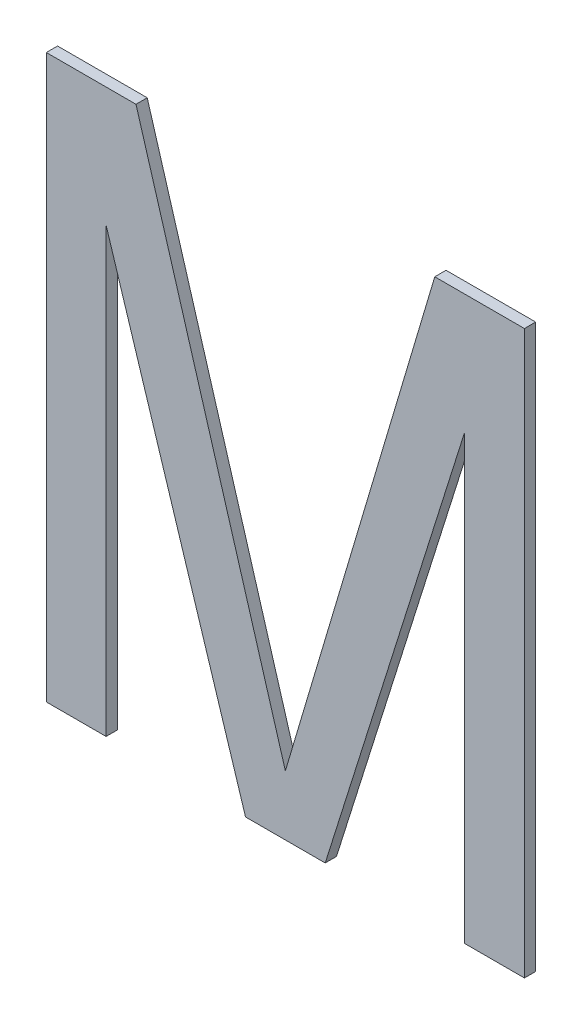
ISO-10303-21;
HEADER;
FILE_DESCRIPTION(('STEP AP214'),'2;1');
FILE_NAME('part.step','',(''),(''),'','','');
FILE_SCHEMA(('AUTOMOTIVE_DESIGN { 1 0 10303 214 1 1 1 1 }'));
ENDSEC;
DATA;
#1=APPLICATION_CONTEXT('core data for automotive mechanical design processes');
#2=APPLICATION_PROTOCOL_DEFINITION('international standard','automotive_design',2000,#1);
#3=PRODUCT_CONTEXT('',#1,'mechanical');
#4=PRODUCT('Part','Part','',(#3));
#5=PRODUCT_RELATED_PRODUCT_CATEGORY('part','',(#4));
#6=PRODUCT_DEFINITION_FORMATION('','',#4);
#7=PRODUCT_DEFINITION_CONTEXT('part definition',#1,'design');
#8=PRODUCT_DEFINITION('design','',#6,#7);
#9=PRODUCT_DEFINITION_SHAPE('','',#8);
#10=(LENGTH_UNIT() NAMED_UNIT(*) SI_UNIT(.MILLI.,.METRE.));
#11=(NAMED_UNIT(*) PLANE_ANGLE_UNIT() SI_UNIT($,.RADIAN.));
#12=(NAMED_UNIT(*) SI_UNIT($,.STERADIAN.) SOLID_ANGLE_UNIT());
#13=UNCERTAINTY_MEASURE_WITH_UNIT(LENGTH_MEASURE(1.E-05),#10,'distance_accuracy_value','');
#14=(GEOMETRIC_REPRESENTATION_CONTEXT(3) GLOBAL_UNCERTAINTY_ASSIGNED_CONTEXT((#13)) GLOBAL_UNIT_ASSIGNED_CONTEXT((#10,
#11,#12)) REPRESENTATION_CONTEXT('',''));
#15=CARTESIAN_POINT('',(0.,0.,0.));
#16=DIRECTION('',(0.,0.,1.));
#17=DIRECTION('',(1.,0.,0.));
#18=AXIS2_PLACEMENT_3D('',#15,#16,#17);
#19=CARTESIAN_POINT('',(152.162872740253,142.200586634191,6.));
#20=DIRECTION('',(0.,0.,1.));
#21=DIRECTION('',(1.,0.,0.));
#22=AXIS2_PLACEMENT_3D('',#19,#20,#21);
#23=PLANE('',#22);
#24=DIRECTION('',(0.28492599218727,-0.958549518270235,0.));
#25=VECTOR('',#24,1.);
#26=CARTESIAN_POINT('',(154.287872740253,142.732501538901,6.));
#27=LINE('',#26,#25);
#28=CARTESIAN_POINT('',(154.287872740253,142.732501538901,6.));
#29=VERTEX_POINT('',#28);
#30=CARTESIAN_POINT('',(152.959747740253,147.200586634191,6.));
#31=VERTEX_POINT('',#30);
#32=EDGE_CURVE('E170',#29,#31,#27,.F.);
#33=ORIENTED_EDGE('',*,*,#32,.T.);
#34=DIRECTION('',(1.,0.,0.));
#35=VECTOR('',#34,1.);
#36=CARTESIAN_POINT('',(152.959747740253,147.200586634191,6.));
#37=LINE('',#36,#35);
#38=CARTESIAN_POINT('',(152.162872740253,147.200586634191,6.));
#39=VERTEX_POINT('',#38);
#40=EDGE_CURVE('E175',#31,#39,#37,.F.);
#41=ORIENTED_EDGE('',*,*,#40,.T.);
#42=DIRECTION('',(0.,1.,0.));
#43=VECTOR('',#42,1.);
#44=CARTESIAN_POINT('',(152.162872740253,147.200586634191,6.));
#45=LINE('',#44,#43);
#46=CARTESIAN_POINT('',(152.162872740253,142.200586634191,6.));
#47=VERTEX_POINT('',#46);
#48=EDGE_CURVE('E112',#39,#47,#45,.F.);
#49=ORIENTED_EDGE('',*,*,#48,.T.);
#50=DIRECTION('',(1.,0.,0.));
#51=VECTOR('',#50,1.);
#52=CARTESIAN_POINT('',(152.162872740253,142.200586634191,6.));
#53=LINE('',#52,#51);
#54=CARTESIAN_POINT('',(152.694122740253,142.200586634191,6.));
#55=VERTEX_POINT('',#54);
#56=EDGE_CURVE('E20',#47,#55,#53,.T.);
#57=ORIENTED_EDGE('',*,*,#56,.T.);
#58=DIRECTION('',(0.,1.,0.));
#59=VECTOR('',#58,1.);
#60=CARTESIAN_POINT('',(152.694122740253,142.200586634191,6.));
#61=LINE('',#60,#59);
#62=CARTESIAN_POINT('',(152.694122740253,146.136756973771,6.));
#63=VERTEX_POINT('',#62);
#64=EDGE_CURVE('E109',#55,#63,#61,.T.);
#65=ORIENTED_EDGE('',*,*,#64,.T.);
#66=DIRECTION('',(-0.300378236881696,0.953820169008731,0.));
#67=VECTOR('',#66,1.);
#68=CARTESIAN_POINT('',(152.694122740253,146.136756973771,6.));
#69=LINE('',#68,#67);
#70=CARTESIAN_POINT('',(153.933706411353,142.200586634191,6.));
#71=VERTEX_POINT('',#70);
#72=EDGE_CURVE('E130',#63,#71,#69,.F.);
#73=ORIENTED_EDGE('',*,*,#72,.T.);
#74=DIRECTION('',(1.,0.,0.));
#75=VECTOR('',#74,1.);
#76=CARTESIAN_POINT('',(153.933706411353,142.200586634191,6.));
#77=LINE('',#76,#75);
#78=CARTESIAN_POINT('',(154.642039575803,142.200586634191,6.));
#79=VERTEX_POINT('',#78);
#80=EDGE_CURVE('E135',#71,#79,#77,.T.);
#81=ORIENTED_EDGE('',*,*,#80,.T.);
#82=DIRECTION('',(-0.300378236879487,-0.953820169009426,0.));
#83=VECTOR('',#82,1.);
#84=CARTESIAN_POINT('',(154.642039575803,142.200586634191,6.));
#85=LINE('',#84,#83);
#86=CARTESIAN_POINT('',(155.881623246893,146.136756973771,6.));
#87=VERTEX_POINT('',#86);
#88=EDGE_CURVE('E140',#79,#87,#85,.F.);
#89=ORIENTED_EDGE('',*,*,#88,.T.);
#90=DIRECTION('',(0.,1.,0.));
#91=VECTOR('',#90,1.);
#92=CARTESIAN_POINT('',(155.881623246893,146.136756973771,6.));
#93=LINE('',#92,#91);
#94=CARTESIAN_POINT('',(155.881623246893,142.200586634191,6.));
#95=VERTEX_POINT('',#94);
#96=EDGE_CURVE('E145',#87,#95,#93,.F.);
#97=ORIENTED_EDGE('',*,*,#96,.T.);
#98=DIRECTION('',(1.,0.,0.));
#99=VECTOR('',#98,1.);
#100=CARTESIAN_POINT('',(155.881623246893,142.200586634191,6.));
#101=LINE('',#100,#99);
#102=CARTESIAN_POINT('',(156.412873246893,142.200586634191,6.));
#103=VERTEX_POINT('',#102);
#104=EDGE_CURVE('E150',#95,#103,#101,.T.);
#105=ORIENTED_EDGE('',*,*,#104,.T.);
#106=DIRECTION('',(0.,1.,0.));
#107=VECTOR('',#106,1.);
#108=CARTESIAN_POINT('',(156.412873246893,142.200586634191,6.));
#109=LINE('',#108,#107);
#110=CARTESIAN_POINT('',(156.412873246893,147.200586634191,6.));
#111=VERTEX_POINT('',#110);
#112=EDGE_CURVE('E155',#103,#111,#109,.T.);
#113=ORIENTED_EDGE('',*,*,#112,.T.);
#114=DIRECTION('',(1.,0.,0.));
#115=VECTOR('',#114,1.);
#116=CARTESIAN_POINT('',(156.412873246893,147.200586634191,6.));
#117=LINE('',#116,#115);
#118=CARTESIAN_POINT('',(155.615998246893,147.200586634191,6.));
#119=VERTEX_POINT('',#118);
#120=EDGE_CURVE('E160',#111,#119,#117,.F.);
#121=ORIENTED_EDGE('',*,*,#120,.T.);
#122=DIRECTION('',(0.284926092054197,0.958549488585083,0.));
#123=VECTOR('',#122,1.);
#124=CARTESIAN_POINT('',(155.615998246893,147.200586634191,6.));
#125=LINE('',#124,#123);
#126=EDGE_CURVE('E165',#119,#29,#125,.F.);
#127=ORIENTED_EDGE('',*,*,#126,.T.);
#128=EDGE_LOOP('',(#33,#41,#49,#57,#65,#73,#81,#89,#97,#105,#113,#121,#127));
#129=FACE_BOUND('',#128,.T.);
#130=ADVANCED_FACE('F17',(#129),#23,.T.);
#131=CARTESIAN_POINT('',(152.162872740253,142.200586634191,6.));
#132=DIRECTION('',(0.,1.,0.));
#133=DIRECTION('',(0.,0.,1.));
#134=AXIS2_PLACEMENT_3D('',#131,#132,#133);
#135=PLANE('',#134);
#136=DIRECTION('',(0.,0.,1.));
#137=VECTOR('',#136,1.);
#138=CARTESIAN_POINT('',(152.694122740253,142.200586634191,6.));
#139=LINE('',#138,#137);
#140=CARTESIAN_POINT('',(152.694122740253,142.200586634191,5.9));
#141=VERTEX_POINT('',#140);
#142=EDGE_CURVE('E117',#141,#55,#139,.T.);
#143=ORIENTED_EDGE('',*,*,#142,.T.);
#144=ORIENTED_EDGE('',*,*,#56,.F.);
#145=DIRECTION('',(0.,0.,-1.));
#146=VECTOR('',#145,1.);
#147=CARTESIAN_POINT('',(152.162872740253,142.200586634191,6.));
#148=LINE('',#147,#146);
#149=CARTESIAN_POINT('',(152.162872740253,142.200586634191,5.9));
#150=VERTEX_POINT('',#149);
#151=EDGE_CURVE('E179',#47,#150,#148,.T.);
#152=ORIENTED_EDGE('',*,*,#151,.T.);
#153=DIRECTION('',(1.,0.,0.));
#154=VECTOR('',#153,1.);
#155=CARTESIAN_POINT('',(152.162872740253,142.200586634191,5.9));
#156=LINE('',#155,#154);
#157=EDGE_CURVE('E127',#150,#141,#156,.T.);
#158=ORIENTED_EDGE('',*,*,#157,.T.);
#159=EDGE_LOOP('',(#143,#144,#152,#158));
#160=FACE_BOUND('',#159,.T.);
#161=ADVANCED_FACE('F126',(#160),#135,.F.);
#162=CARTESIAN_POINT('',(152.694122740253,142.200586634191,6.));
#163=DIRECTION('',(-1.,0.,0.));
#164=DIRECTION('',(0.,0.,1.));
#165=AXIS2_PLACEMENT_3D('',#162,#163,#164);
#166=PLANE('',#165);
#167=DIRECTION('',(0.,0.,1.));
#168=VECTOR('',#167,1.);
#169=CARTESIAN_POINT('',(152.694122740253,146.136756973771,6.));
#170=LINE('',#169,#168);
#171=CARTESIAN_POINT('',(152.694122740253,146.136756973771,5.9));
#172=VERTEX_POINT('',#171);
#173=EDGE_CURVE('E123',#172,#63,#170,.T.);
#174=ORIENTED_EDGE('',*,*,#173,.T.);
#175=ORIENTED_EDGE('',*,*,#64,.F.);
#176=ORIENTED_EDGE('',*,*,#142,.F.);
#177=DIRECTION('',(0.,1.,0.));
#178=VECTOR('',#177,1.);
#179=CARTESIAN_POINT('',(152.694122740253,142.200586634191,5.9));
#180=LINE('',#179,#178);
#181=EDGE_CURVE('E182',#141,#172,#180,.T.);
#182=ORIENTED_EDGE('',*,*,#181,.T.);
#183=EDGE_LOOP('',(#174,#175,#176,#182));
#184=FACE_BOUND('',#183,.T.);
#185=ADVANCED_FACE('F120',(#184),#166,.F.);
#186=CARTESIAN_POINT('',(152.694122740253,146.136756973771,6.));
#187=DIRECTION('',(0.953820169008731,0.300378236881696,0.));
#188=DIRECTION('',(-0.300378236881696,0.953820169008731,0.));
#189=AXIS2_PLACEMENT_3D('',#186,#187,#188);
#190=PLANE('',#189);
#191=DIRECTION('',(0.,0.,1.));
#192=VECTOR('',#191,1.);
#193=CARTESIAN_POINT('',(153.933706411353,142.200586634191,6.));
#194=LINE('',#193,#192);
#195=CARTESIAN_POINT('',(153.933706411353,142.200586634191,5.9));
#196=VERTEX_POINT('',#195);
#197=EDGE_CURVE('E132',#196,#71,#194,.T.);
#198=ORIENTED_EDGE('',*,*,#197,.T.);
#199=ORIENTED_EDGE('',*,*,#72,.F.);
#200=ORIENTED_EDGE('',*,*,#173,.F.);
#201=DIRECTION('',(0.300378236881714,-0.953820169008725,0.));
#202=VECTOR('',#201,1.);
#203=CARTESIAN_POINT('',(152.694122740253,146.136756973771,5.9));
#204=LINE('',#203,#202);
#205=EDGE_CURVE('E184',#172,#196,#204,.T.);
#206=ORIENTED_EDGE('',*,*,#205,.T.);
#207=EDGE_LOOP('',(#198,#199,#200,#206));
#208=FACE_BOUND('',#207,.T.);
#209=ADVANCED_FACE('F252',(#208),#190,.F.);
#210=CARTESIAN_POINT('',(153.933706411353,142.200586634191,6.));
#211=DIRECTION('',(0.,1.,0.));
#212=DIRECTION('',(0.,0.,1.));
#213=AXIS2_PLACEMENT_3D('',#210,#211,#212);
#214=PLANE('',#213);
#215=DIRECTION('',(0.,0.,1.));
#216=VECTOR('',#215,1.);
#217=CARTESIAN_POINT('',(154.642039575803,142.200586634191,6.));
#218=LINE('',#217,#216);
#219=CARTESIAN_POINT('',(154.642039575803,142.200586634191,5.9));
#220=VERTEX_POINT('',#219);
#221=EDGE_CURVE('E137',#220,#79,#218,.T.);
#222=ORIENTED_EDGE('',*,*,#221,.T.);
#223=ORIENTED_EDGE('',*,*,#80,.F.);
#224=ORIENTED_EDGE('',*,*,#197,.F.);
#225=DIRECTION('',(1.,0.,0.));
#226=VECTOR('',#225,1.);
#227=CARTESIAN_POINT('',(152.162872740253,142.200586634191,5.9));
#228=LINE('',#227,#226);
#229=EDGE_CURVE('E187',#196,#220,#228,.T.);
#230=ORIENTED_EDGE('',*,*,#229,.T.);
#231=EDGE_LOOP('',(#222,#223,#224,#230));
#232=FACE_BOUND('',#231,.T.);
#233=ADVANCED_FACE('F249',(#232),#214,.F.);
#234=CARTESIAN_POINT('',(154.642039575803,142.200586634191,6.));
#235=DIRECTION('',(-0.953820169009426,0.300378236879487,0.));
#236=DIRECTION('',(-0.300378236879487,-0.953820169009426,0.));
#237=AXIS2_PLACEMENT_3D('',#234,#235,#236);
#238=PLANE('',#237);
#239=DIRECTION('',(0.,0.,-1.));
#240=VECTOR('',#239,1.);
#241=CARTESIAN_POINT('',(155.881623246893,146.136756973771,6.));
#242=LINE('',#241,#240);
#243=CARTESIAN_POINT('',(155.881623246893,146.136756973771,5.9));
#244=VERTEX_POINT('',#243);
#245=EDGE_CURVE('E142',#244,#87,#242,.F.);
#246=ORIENTED_EDGE('',*,*,#245,.T.);
#247=ORIENTED_EDGE('',*,*,#88,.F.);
#248=ORIENTED_EDGE('',*,*,#221,.F.);
#249=DIRECTION('',(0.300378236879493,0.953820169009425,0.));
#250=VECTOR('',#249,1.);
#251=CARTESIAN_POINT('',(154.642039575803,142.200586634191,5.9));
#252=LINE('',#251,#250);
#253=EDGE_CURVE('E190',#220,#244,#252,.T.);
#254=ORIENTED_EDGE('',*,*,#253,.T.);
#255=EDGE_LOOP('',(#246,#247,#248,#254));
#256=FACE_BOUND('',#255,.T.);
#257=ADVANCED_FACE('F245',(#256),#238,.F.);
#258=CARTESIAN_POINT('',(155.881623246893,146.136756973771,6.));
#259=DIRECTION('',(1.,0.,0.));
#260=DIRECTION('',(0.,0.,-1.));
#261=AXIS2_PLACEMENT_3D('',#258,#259,#260);
#262=PLANE('',#261);
#263=DIRECTION('',(0.,0.,1.));
#264=VECTOR('',#263,1.);
#265=CARTESIAN_POINT('',(155.881623246893,142.200586634191,6.));
#266=LINE('',#265,#264);
#267=CARTESIAN_POINT('',(155.881623246893,142.200586634191,5.9));
#268=VERTEX_POINT('',#267);
#269=EDGE_CURVE('E147',#268,#95,#266,.T.);
#270=ORIENTED_EDGE('',*,*,#269,.T.);
#271=ORIENTED_EDGE('',*,*,#96,.F.);
#272=ORIENTED_EDGE('',*,*,#245,.F.);
#273=DIRECTION('',(0.,1.,0.));
#274=VECTOR('',#273,1.);
#275=CARTESIAN_POINT('',(155.881623246893,142.200586634191,5.9));
#276=LINE('',#275,#274);
#277=EDGE_CURVE('E193',#244,#268,#276,.F.);
#278=ORIENTED_EDGE('',*,*,#277,.T.);
#279=EDGE_LOOP('',(#270,#271,#272,#278));
#280=FACE_BOUND('',#279,.T.);
#281=ADVANCED_FACE('F241',(#280),#262,.F.);
#282=CARTESIAN_POINT('',(155.881623246893,142.200586634191,6.));
#283=DIRECTION('',(0.,1.,0.));
#284=DIRECTION('',(0.,0.,1.));
#285=AXIS2_PLACEMENT_3D('',#282,#283,#284);
#286=PLANE('',#285);
#287=DIRECTION('',(0.,0.,1.));
#288=VECTOR('',#287,1.);
#289=CARTESIAN_POINT('',(156.412873246893,142.200586634191,6.));
#290=LINE('',#289,#288);
#291=CARTESIAN_POINT('',(156.412873246893,142.200586634191,5.9));
#292=VERTEX_POINT('',#291);
#293=EDGE_CURVE('E152',#292,#103,#290,.T.);
#294=ORIENTED_EDGE('',*,*,#293,.T.);
#295=ORIENTED_EDGE('',*,*,#104,.F.);
#296=ORIENTED_EDGE('',*,*,#269,.F.);
#297=DIRECTION('',(1.,0.,0.));
#298=VECTOR('',#297,1.);
#299=CARTESIAN_POINT('',(152.162872740253,142.200586634191,5.9));
#300=LINE('',#299,#298);
#301=EDGE_CURVE('E196',#268,#292,#300,.T.);
#302=ORIENTED_EDGE('',*,*,#301,.T.);
#303=EDGE_LOOP('',(#294,#295,#296,#302));
#304=FACE_BOUND('',#303,.T.);
#305=ADVANCED_FACE('F237',(#304),#286,.F.);
#306=CARTESIAN_POINT('',(156.412873246893,142.200586634191,6.));
#307=DIRECTION('',(-1.,0.,0.));
#308=DIRECTION('',(0.,0.,1.));
#309=AXIS2_PLACEMENT_3D('',#306,#307,#308);
#310=PLANE('',#309);
#311=DIRECTION('',(0.,0.,-1.));
#312=VECTOR('',#311,1.);
#313=CARTESIAN_POINT('',(156.412873246893,147.200586634191,6.));
#314=LINE('',#313,#312);
#315=CARTESIAN_POINT('',(156.412873246893,147.200586634191,5.9));
#316=VERTEX_POINT('',#315);
#317=EDGE_CURVE('E157',#316,#111,#314,.F.);
#318=ORIENTED_EDGE('',*,*,#317,.T.);
#319=ORIENTED_EDGE('',*,*,#112,.F.);
#320=ORIENTED_EDGE('',*,*,#293,.F.);
#321=DIRECTION('',(0.,1.,0.));
#322=VECTOR('',#321,1.);
#323=CARTESIAN_POINT('',(156.412873246893,142.200586634191,5.9));
#324=LINE('',#323,#322);
#325=EDGE_CURVE('E199',#292,#316,#324,.T.);
#326=ORIENTED_EDGE('',*,*,#325,.T.);
#327=EDGE_LOOP('',(#318,#319,#320,#326));
#328=FACE_BOUND('',#327,.T.);
#329=ADVANCED_FACE('F233',(#328),#310,.F.);
#330=CARTESIAN_POINT('',(156.412873246893,147.200586634191,6.));
#331=DIRECTION('',(0.,-1.,0.));
#332=DIRECTION('',(0.,0.,-1.));
#333=AXIS2_PLACEMENT_3D('',#330,#331,#332);
#334=PLANE('',#333);
#335=DIRECTION('',(0.,0.,1.));
#336=VECTOR('',#335,1.);
#337=CARTESIAN_POINT('',(155.615998246893,147.200586634191,6.));
#338=LINE('',#337,#336);
#339=CARTESIAN_POINT('',(155.615998246893,147.200586634191,5.9));
#340=VERTEX_POINT('',#339);
#341=EDGE_CURVE('E162',#340,#119,#338,.T.);
#342=ORIENTED_EDGE('',*,*,#341,.T.);
#343=ORIENTED_EDGE('',*,*,#120,.F.);
#344=ORIENTED_EDGE('',*,*,#317,.F.);
#345=DIRECTION('',(1.,0.,0.));
#346=VECTOR('',#345,1.);
#347=CARTESIAN_POINT('',(152.162872740253,147.200586634191,5.9));
#348=LINE('',#347,#346);
#349=EDGE_CURVE('E202',#316,#340,#348,.F.);
#350=ORIENTED_EDGE('',*,*,#349,.T.);
#351=EDGE_LOOP('',(#342,#343,#344,#350));
#352=FACE_BOUND('',#351,.T.);
#353=ADVANCED_FACE('F229',(#352),#334,.F.);
#354=CARTESIAN_POINT('',(155.615998246893,147.200586634191,6.));
#355=DIRECTION('',(0.958549488585083,-0.284926092054197,0.));
#356=DIRECTION('',(0.284926092054197,0.958549488585083,0.));
#357=AXIS2_PLACEMENT_3D('',#354,#355,#356);
#358=PLANE('',#357);
#359=DIRECTION('',(0.,0.,1.));
#360=VECTOR('',#359,1.);
#361=CARTESIAN_POINT('',(154.287872740253,142.732501538901,6.));
#362=LINE('',#361,#360);
#363=CARTESIAN_POINT('',(154.287872740253,142.732501538901,5.9));
#364=VERTEX_POINT('',#363);
#365=EDGE_CURVE('E167',#364,#29,#362,.T.);
#366=ORIENTED_EDGE('',*,*,#365,.T.);
#367=ORIENTED_EDGE('',*,*,#126,.F.);
#368=ORIENTED_EDGE('',*,*,#341,.F.);
#369=DIRECTION('',(-0.284926092054221,-0.958549488585075,0.));
#370=VECTOR('',#369,1.);
#371=CARTESIAN_POINT('',(155.615998246893,147.200586634191,5.9));
#372=LINE('',#371,#370);
#373=EDGE_CURVE('E205',#340,#364,#372,.T.);
#374=ORIENTED_EDGE('',*,*,#373,.T.);
#375=EDGE_LOOP('',(#366,#367,#368,#374));
#376=FACE_BOUND('',#375,.T.);
#377=ADVANCED_FACE('F225',(#376),#358,.F.);
#378=CARTESIAN_POINT('',(154.287872740253,142.732501538901,6.));
#379=DIRECTION('',(-0.958549518270235,-0.28492599218727,0.));
#380=DIRECTION('',(0.28492599218727,-0.958549518270235,0.));
#381=AXIS2_PLACEMENT_3D('',#378,#379,#380);
#382=PLANE('',#381);
#383=DIRECTION('',(0.,0.,-1.));
#384=VECTOR('',#383,1.);
#385=CARTESIAN_POINT('',(152.959747740253,147.200586634191,6.));
#386=LINE('',#385,#384);
#387=CARTESIAN_POINT('',(152.959747740253,147.200586634191,5.9));
#388=VERTEX_POINT('',#387);
#389=EDGE_CURVE('E172',#388,#31,#386,.F.);
#390=ORIENTED_EDGE('',*,*,#389,.T.);
#391=ORIENTED_EDGE('',*,*,#32,.F.);
#392=ORIENTED_EDGE('',*,*,#365,.F.);
#393=DIRECTION('',(-0.284925992187267,0.958549518270236,0.));
#394=VECTOR('',#393,1.);
#395=CARTESIAN_POINT('',(154.287872740253,142.732501538901,5.9));
#396=LINE('',#395,#394);
#397=EDGE_CURVE('E208',#364,#388,#396,.T.);
#398=ORIENTED_EDGE('',*,*,#397,.T.);
#399=EDGE_LOOP('',(#390,#391,#392,#398));
#400=FACE_BOUND('',#399,.T.);
#401=ADVANCED_FACE('F221',(#400),#382,.F.);
#402=CARTESIAN_POINT('',(152.959747740253,147.200586634191,6.));
#403=DIRECTION('',(0.,-1.,0.));
#404=DIRECTION('',(0.,0.,-1.));
#405=AXIS2_PLACEMENT_3D('',#402,#403,#404);
#406=PLANE('',#405);
#407=DIRECTION('',(0.,0.,-1.));
#408=VECTOR('',#407,1.);
#409=CARTESIAN_POINT('',(152.162872740253,147.200586634191,6.));
#410=LINE('',#409,#408);
#411=CARTESIAN_POINT('',(152.162872740253,147.200586634191,5.9));
#412=VERTEX_POINT('',#411);
#413=EDGE_CURVE('E34',#412,#39,#410,.F.);
#414=ORIENTED_EDGE('',*,*,#413,.T.);
#415=ORIENTED_EDGE('',*,*,#40,.F.);
#416=ORIENTED_EDGE('',*,*,#389,.F.);
#417=DIRECTION('',(1.,0.,0.));
#418=VECTOR('',#417,1.);
#419=CARTESIAN_POINT('',(152.162872740253,147.200586634191,5.9));
#420=LINE('',#419,#418);
#421=EDGE_CURVE('E26',#388,#412,#420,.F.);
#422=ORIENTED_EDGE('',*,*,#421,.T.);
#423=EDGE_LOOP('',(#414,#415,#416,#422));
#424=FACE_BOUND('',#423,.T.);
#425=ADVANCED_FACE('F214',(#424),#406,.F.);
#426=CARTESIAN_POINT('',(152.162872740253,147.200586634191,6.));
#427=DIRECTION('',(1.,0.,0.));
#428=DIRECTION('',(0.,0.,-1.));
#429=AXIS2_PLACEMENT_3D('',#426,#427,#428);
#430=PLANE('',#429);
#431=ORIENTED_EDGE('',*,*,#151,.F.);
#432=ORIENTED_EDGE('',*,*,#48,.F.);
#433=ORIENTED_EDGE('',*,*,#413,.F.);
#434=DIRECTION('',(0.,1.,0.));
#435=VECTOR('',#434,1.);
#436=CARTESIAN_POINT('',(152.162872740253,142.200586634191,5.9));
#437=LINE('',#436,#435);
#438=EDGE_CURVE('E11',#412,#150,#437,.F.);
#439=ORIENTED_EDGE('',*,*,#438,.T.);
#440=EDGE_LOOP('',(#431,#432,#433,#439));
#441=FACE_BOUND('',#440,.T.);
#442=ADVANCED_FACE('F253',(#441),#430,.F.);
#443=CARTESIAN_POINT('',(152.162872740253,142.200586634191,5.9));
#444=DIRECTION('',(0.,0.,1.));
#445=DIRECTION('',(1.,0.,0.));
#446=AXIS2_PLACEMENT_3D('',#443,#444,#445);
#447=PLANE('',#446);
#448=ORIENTED_EDGE('',*,*,#421,.F.);
#449=ORIENTED_EDGE('',*,*,#397,.F.);
#450=ORIENTED_EDGE('',*,*,#373,.F.);
#451=ORIENTED_EDGE('',*,*,#349,.F.);
#452=ORIENTED_EDGE('',*,*,#325,.F.);
#453=ORIENTED_EDGE('',*,*,#301,.F.);
#454=ORIENTED_EDGE('',*,*,#277,.F.);
#455=ORIENTED_EDGE('',*,*,#253,.F.);
#456=ORIENTED_EDGE('',*,*,#229,.F.);
#457=ORIENTED_EDGE('',*,*,#205,.F.);
#458=ORIENTED_EDGE('',*,*,#181,.F.);
#459=ORIENTED_EDGE('',*,*,#157,.F.);
#460=ORIENTED_EDGE('',*,*,#438,.F.);
#461=EDGE_LOOP('',(#448,#449,#450,#451,#452,#453,#454,#455,#456,#457,#458,#459,#460));
#462=FACE_BOUND('',#461,.T.);
#463=ADVANCED_FACE('F218',(#462),#447,.F.);
#464=CLOSED_SHELL('',(#130,#161,#185,#209,#233,#257,#281,#305,#329,#353,#377,#401,#425,#442,#463));
#465=MANIFOLD_SOLID_BREP('B1',#464);
#466=ADVANCED_BREP_SHAPE_REPRESENTATION('',(#18,#465),#14);
#467=SHAPE_DEFINITION_REPRESENTATION(#9,#466);
ENDSEC;
END-ISO-10303-21;
